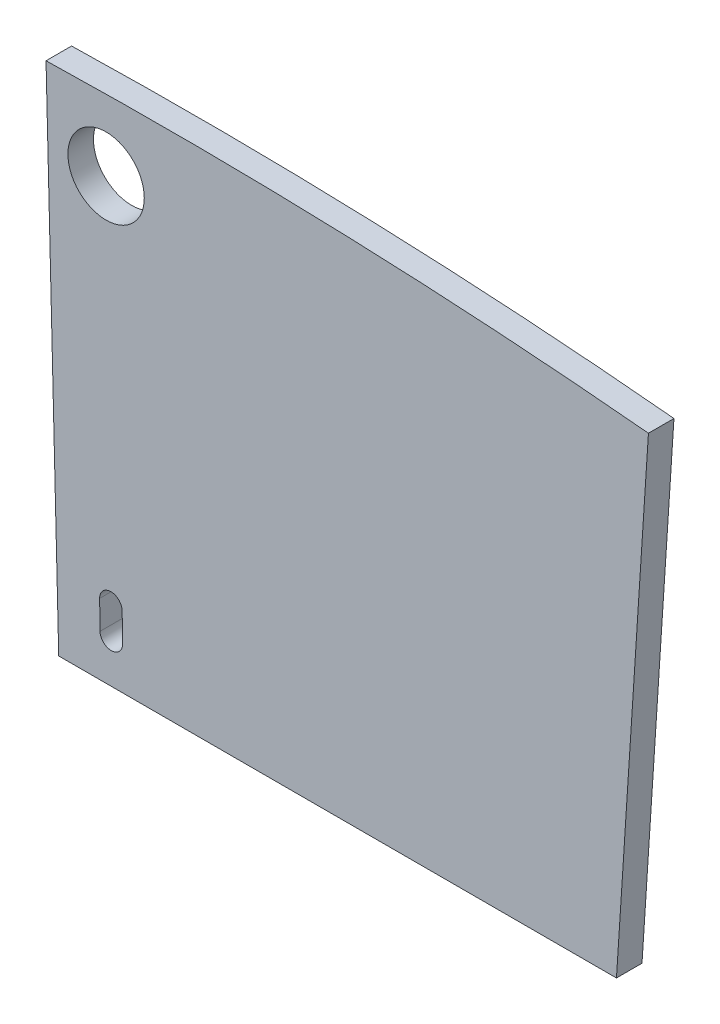
ISO-10303-21;
HEADER;
FILE_DESCRIPTION(('STEP AP214'),'2;1');
FILE_NAME('part.step','',(''),(''),'','','');
FILE_SCHEMA(('AUTOMOTIVE_DESIGN { 1 0 10303 214 1 1 1 1 }'));
ENDSEC;
DATA;
#1=APPLICATION_CONTEXT('core data for automotive mechanical design processes');
#2=APPLICATION_PROTOCOL_DEFINITION('international standard','automotive_design',2000,#1);
#3=PRODUCT_CONTEXT('',#1,'mechanical');
#4=PRODUCT('Part','Part','',(#3));
#5=PRODUCT_RELATED_PRODUCT_CATEGORY('part','',(#4));
#6=PRODUCT_DEFINITION_FORMATION('','',#4);
#7=PRODUCT_DEFINITION_CONTEXT('part definition',#1,'design');
#8=PRODUCT_DEFINITION('design','',#6,#7);
#9=PRODUCT_DEFINITION_SHAPE('','',#8);
#10=(LENGTH_UNIT() NAMED_UNIT(*) SI_UNIT(.MILLI.,.METRE.));
#11=(NAMED_UNIT(*) PLANE_ANGLE_UNIT() SI_UNIT($,.RADIAN.));
#12=(NAMED_UNIT(*) SI_UNIT($,.STERADIAN.) SOLID_ANGLE_UNIT());
#13=UNCERTAINTY_MEASURE_WITH_UNIT(LENGTH_MEASURE(1.E-05),#10,'distance_accuracy_value','');
#14=(GEOMETRIC_REPRESENTATION_CONTEXT(3) GLOBAL_UNCERTAINTY_ASSIGNED_CONTEXT((#13)) GLOBAL_UNIT_ASSIGNED_CONTEXT((#10,
#11,#12)) REPRESENTATION_CONTEXT('',''));
#15=CARTESIAN_POINT('',(0.,0.,0.));
#16=DIRECTION('',(0.,0.,1.));
#17=DIRECTION('',(1.,0.,0.));
#18=AXIS2_PLACEMENT_3D('',#15,#16,#17);
#19=CARTESIAN_POINT('',(-16.337044404827,167.45476352,0.899999999999998));
#20=DIRECTION('',(0.,0.,-1.));
#21=DIRECTION('',(-1.,0.,0.));
#22=AXIS2_PLACEMENT_3D('',#19,#20,#21);
#23=PLANE('',#22);
#24=CARTESIAN_POINT('',(-2.27104483273081,173.485135834076,0.899999999999998));
#25=DIRECTION('',(0.,0.,1.));
#26=DIRECTION('',(1.,0.,0.));
#27=AXIS2_PLACEMENT_3D('',#24,#25,#26);
#28=CIRCLE('',#27,1.34620000105857);
#29=CARTESIAN_POINT('',(-0.924844831672239,173.485135834076,0.899999999999998));
#30=VERTEX_POINT('',#29);
#31=EDGE_CURVE('E129',#30,#30,#28,.T.);
#32=ORIENTED_EDGE('',*,*,#31,.F.);
#33=EDGE_LOOP('',(#32));
#34=FACE_BOUND('',#33,.T.);
#35=CARTESIAN_POINT('',(0.,0.,0.900000000000001));
#36=DIRECTION('',(0.,0.,-1.));
#37=DIRECTION('',(1.,0.,0.));
#38=AXIS2_PLACEMENT_3D('',#35,#36,#37);
#39=CIRCLE('',#38,176.);
#40=CARTESIAN_POINT('',(-4.38748846474292,175.945303844609,0.899999999999998));
#41=VERTEX_POINT('',#40);
#42=CARTESIAN_POINT('',(16.8441765698866,175.192105175098,0.899999999999998));
#43=VERTEX_POINT('',#42);
#44=EDGE_CURVE('E113',#41,#43,#39,.T.);
#45=ORIENTED_EDGE('',*,*,#44,.F.);
#46=DIRECTION('',(0.0249289117314939,-0.999689226389823,0.));
#47=VECTOR('',#46,1.);
#48=CARTESIAN_POINT('',(-3.9399924992691,158.,0.899999999999998));
#49=LINE('',#48,#47);
#50=CARTESIAN_POINT('',(-3.9399924992691,158.,0.899999999999998));
#51=VERTEX_POINT('',#50);
#52=EDGE_CURVE('E49',#41,#51,#49,.T.);
#53=ORIENTED_EDGE('',*,*,#52,.T.);
#54=DIRECTION('',(-1.,0.,0.));
#55=VECTOR('',#54,1.);
#56=CARTESIAN_POINT('',(-15.7173464636271,158.,0.899999999999998));
#57=LINE('',#56,#55);
#58=CARTESIAN_POINT('',(15.717346463627,158.,0.899999999999998));
#59=VERTEX_POINT('',#58);
#60=EDGE_CURVE('E112',#59,#51,#57,.T.);
#61=ORIENTED_EDGE('',*,*,#60,.F.);
#62=DIRECTION('',(0.0654031292301392,0.997858923238604,0.));
#63=VECTOR('',#62,1.);
#64=CARTESIAN_POINT('',(16.0020624745624,162.343926895318,0.899999999999998));
#65=LINE('',#64,#63);
#66=EDGE_CURVE('E11',#59,#43,#65,.T.);
#67=ORIENTED_EDGE('',*,*,#66,.T.);
#68=EDGE_LOOP('',(#45,#53,#61,#67));
#69=FACE_BOUND('',#68,.T.);
#70=CARTESIAN_POINT('',(-2.10088065097746,160.486292411828,0.899999999999998));
#71=DIRECTION('',(0.,0.,1.));
#72=DIRECTION('',(1.,0.,0.));
#73=AXIS2_PLACEMENT_3D('',#70,#71,#72);
#74=CIRCLE('',#73,0.396875);
#75=CARTESIAN_POINT('',(-1.70403965222157,160.491487345073,0.899999999999998));
#76=VERTEX_POINT('',#75);
#77=CARTESIAN_POINT('',(-2.49772164973337,160.481097478583,0.899999999999998));
#78=VERTEX_POINT('',#77);
#79=EDGE_CURVE('E141',#76,#78,#74,.T.);
#80=ORIENTED_EDGE('',*,*,#79,.F.);
#81=DIRECTION('',(-0.0130895955776994,0.999914327573924,0.));
#82=VECTOR('',#81,1.);
#83=CARTESIAN_POINT('',(-1.70403965222157,160.491487345073,0.899999999999998));
#84=LINE('',#83,#82);
#85=CARTESIAN_POINT('',(-1.69094893513037,159.491487345073,0.899999999999998));
#86=VERTEX_POINT('',#85);
#87=EDGE_CURVE('E148',#86,#76,#84,.T.);
#88=ORIENTED_EDGE('',*,*,#87,.F.);
#89=CARTESIAN_POINT('',(-2.08778993388627,159.486292411828,0.899999999999998));
#90=DIRECTION('',(0.,0.,1.));
#91=DIRECTION('',(-1.,0.,0.));
#92=AXIS2_PLACEMENT_3D('',#89,#90,#91);
#93=CIRCLE('',#92,0.396875);
#94=CARTESIAN_POINT('',(-2.48463093264218,159.481097478583,0.899999999999998));
#95=VERTEX_POINT('',#94);
#96=EDGE_CURVE('E146',#95,#86,#93,.T.);
#97=ORIENTED_EDGE('',*,*,#96,.F.);
#98=DIRECTION('',(0.0130895955776989,-0.999914327573924,0.));
#99=VECTOR('',#98,1.);
#100=CARTESIAN_POINT('',(-2.49772164973337,160.481097478583,0.899999999999998));
#101=LINE('',#100,#99);
#102=EDGE_CURVE('E143',#78,#95,#101,.T.);
#103=ORIENTED_EDGE('',*,*,#102,.F.);
#104=EDGE_LOOP('',(#80,#88,#97,#103));
#105=FACE_BOUND('',#104,.T.);
#106=ADVANCED_FACE('F34',(#34,#69,#105),#23,.F.);
#107=CARTESIAN_POINT('',(-16.337044404827,167.45476352,0.));
#108=DIRECTION('',(0.,0.,-1.));
#109=DIRECTION('',(-1.,0.,0.));
#110=AXIS2_PLACEMENT_3D('',#107,#108,#109);
#111=PLANE('',#110);
#112=DIRECTION('',(0.0249289117314939,-0.999689226389823,0.));
#113=VECTOR('',#112,1.);
#114=CARTESIAN_POINT('',(-3.9399924992691,158.,0.));
#115=LINE('',#114,#113);
#116=CARTESIAN_POINT('',(-4.38748846474292,175.945303844609,0.));
#117=VERTEX_POINT('',#116);
#118=CARTESIAN_POINT('',(-3.9399924992691,158.,0.));
#119=VERTEX_POINT('',#118);
#120=EDGE_CURVE('E100',#117,#119,#115,.T.);
#121=ORIENTED_EDGE('',*,*,#120,.F.);
#122=CARTESIAN_POINT('',(0.,0.,0.));
#123=DIRECTION('',(0.,0.,-1.));
#124=DIRECTION('',(1.,0.,0.));
#125=AXIS2_PLACEMENT_3D('',#122,#123,#124);
#126=CIRCLE('',#125,176.);
#127=CARTESIAN_POINT('',(16.8441765698866,175.192105175098,0.));
#128=VERTEX_POINT('',#127);
#129=EDGE_CURVE('E127',#117,#128,#126,.T.);
#130=ORIENTED_EDGE('',*,*,#129,.T.);
#131=DIRECTION('',(0.0654031292301392,0.997858923238604,0.));
#132=VECTOR('',#131,1.);
#133=CARTESIAN_POINT('',(16.0020624745624,162.343926895318,0.));
#134=LINE('',#133,#132);
#135=CARTESIAN_POINT('',(15.717346463627,158.,0.));
#136=VERTEX_POINT('',#135);
#137=EDGE_CURVE('E38',#136,#128,#134,.T.);
#138=ORIENTED_EDGE('',*,*,#137,.F.);
#139=DIRECTION('',(-1.,0.,0.));
#140=VECTOR('',#139,1.);
#141=CARTESIAN_POINT('',(-15.7173464636271,158.,0.));
#142=LINE('',#141,#140);
#143=EDGE_CURVE('E123',#136,#119,#142,.T.);
#144=ORIENTED_EDGE('',*,*,#143,.T.);
#145=EDGE_LOOP('',(#121,#130,#138,#144));
#146=FACE_BOUND('',#145,.T.);
#147=CARTESIAN_POINT('',(-2.27104483273081,173.485135834076,0.));
#148=DIRECTION('',(0.,0.,1.));
#149=DIRECTION('',(1.,0.,0.));
#150=AXIS2_PLACEMENT_3D('',#147,#148,#149);
#151=CIRCLE('',#150,1.34620000105857);
#152=CARTESIAN_POINT('',(-0.924844831672239,173.485135834076,0.));
#153=VERTEX_POINT('',#152);
#154=EDGE_CURVE('E169',#153,#153,#151,.T.);
#155=ORIENTED_EDGE('',*,*,#154,.T.);
#156=EDGE_LOOP('',(#155));
#157=FACE_BOUND('',#156,.T.);
#158=DIRECTION('',(-0.0130895955776994,0.999914327573924,0.));
#159=VECTOR('',#158,1.);
#160=CARTESIAN_POINT('',(-1.70403965222157,160.491487345073,0.));
#161=LINE('',#160,#159);
#162=CARTESIAN_POINT('',(-1.69094893513037,159.491487345073,0.));
#163=VERTEX_POINT('',#162);
#164=CARTESIAN_POINT('',(-1.70403965222157,160.491487345073,0.));
#165=VERTEX_POINT('',#164);
#166=EDGE_CURVE('E144',#163,#165,#161,.T.);
#167=ORIENTED_EDGE('',*,*,#166,.T.);
#168=CARTESIAN_POINT('',(-2.10088065097746,160.486292411828,0.));
#169=DIRECTION('',(0.,0.,1.));
#170=DIRECTION('',(1.,0.,0.));
#171=AXIS2_PLACEMENT_3D('',#168,#169,#170);
#172=CIRCLE('',#171,0.396875);
#173=CARTESIAN_POINT('',(-2.49772164973337,160.481097478583,0.));
#174=VERTEX_POINT('',#173);
#175=EDGE_CURVE('E105',#165,#174,#172,.T.);
#176=ORIENTED_EDGE('',*,*,#175,.T.);
#177=DIRECTION('',(0.0130895955776989,-0.999914327573924,0.));
#178=VECTOR('',#177,1.);
#179=CARTESIAN_POINT('',(-2.49772164973337,160.481097478583,0.));
#180=LINE('',#179,#178);
#181=CARTESIAN_POINT('',(-2.48463093264218,159.481097478583,0.));
#182=VERTEX_POINT('',#181);
#183=EDGE_CURVE('E153',#174,#182,#180,.T.);
#184=ORIENTED_EDGE('',*,*,#183,.T.);
#185=CARTESIAN_POINT('',(-2.08778993388627,159.486292411828,0.));
#186=DIRECTION('',(0.,0.,1.));
#187=DIRECTION('',(-1.,0.,0.));
#188=AXIS2_PLACEMENT_3D('',#185,#186,#187);
#189=CIRCLE('',#188,0.396875);
#190=EDGE_CURVE('E156',#182,#163,#189,.T.);
#191=ORIENTED_EDGE('',*,*,#190,.T.);
#192=EDGE_LOOP('',(#167,#176,#184,#191));
#193=FACE_BOUND('',#192,.T.);
#194=ADVANCED_FACE('F174',(#146,#157,#193),#111,.T.);
#195=CARTESIAN_POINT('',(-15.7173464636271,158.,0.899999999999998));
#196=DIRECTION('',(0.,-1.,0.));
#197=DIRECTION('',(0.,0.,-1.));
#198=AXIS2_PLACEMENT_3D('',#195,#196,#197);
#199=PLANE('',#198);
#200=DIRECTION('',(0.,0.,-1.));
#201=VECTOR('',#200,1.);
#202=CARTESIAN_POINT('',(-3.9399924992691,158.,0.899999999999998));
#203=LINE('',#202,#201);
#204=EDGE_CURVE('E97',#51,#119,#203,.T.);
#205=ORIENTED_EDGE('',*,*,#204,.T.);
#206=ORIENTED_EDGE('',*,*,#143,.F.);
#207=DIRECTION('',(0.,0.,-1.));
#208=VECTOR('',#207,1.);
#209=CARTESIAN_POINT('',(15.717346463627,158.,0.899999999999998));
#210=LINE('',#209,#208);
#211=EDGE_CURVE('E118',#59,#136,#210,.T.);
#212=ORIENTED_EDGE('',*,*,#211,.F.);
#213=ORIENTED_EDGE('',*,*,#60,.T.);
#214=EDGE_LOOP('',(#205,#206,#212,#213));
#215=FACE_BOUND('',#214,.T.);
#216=ADVANCED_FACE('F116',(#215),#199,.T.);
#217=CARTESIAN_POINT('',(16.0020624745624,162.343926895318,0.899999999999998));
#218=DIRECTION('',(-0.997858923238604,0.0654031292301395,0.));
#219=DIRECTION('',(-0.0654031292301392,-0.997858923238604,0.));
#220=AXIS2_PLACEMENT_3D('',#217,#218,#219);
#221=PLANE('',#220);
#222=ORIENTED_EDGE('',*,*,#137,.T.);
#223=DIRECTION('',(0.,0.,-1.));
#224=VECTOR('',#223,1.);
#225=CARTESIAN_POINT('',(16.8441765698866,175.192105175098,0.899999999999998));
#226=LINE('',#225,#224);
#227=EDGE_CURVE('E119',#43,#128,#226,.T.);
#228=ORIENTED_EDGE('',*,*,#227,.F.);
#229=ORIENTED_EDGE('',*,*,#66,.F.);
#230=ORIENTED_EDGE('',*,*,#211,.T.);
#231=EDGE_LOOP('',(#222,#228,#229,#230));
#232=FACE_BOUND('',#231,.T.);
#233=ADVANCED_FACE('F36',(#232),#221,.F.);
#234=CARTESIAN_POINT('',(0.,0.,0.900000000000001));
#235=DIRECTION('',(0.,0.,-1.));
#236=DIRECTION('',(-1.,0.,0.));
#237=AXIS2_PLACEMENT_3D('',#234,#235,#236);
#238=CYLINDRICAL_SURFACE('',#237,176.);
#239=DIRECTION('',(0.,0.,-1.));
#240=VECTOR('',#239,1.);
#241=CARTESIAN_POINT('',(-4.38748846474292,175.945303844609,0.899999999999998));
#242=LINE('',#241,#240);
#243=EDGE_CURVE('E106',#41,#117,#242,.T.);
#244=ORIENTED_EDGE('',*,*,#243,.F.);
#245=ORIENTED_EDGE('',*,*,#44,.T.);
#246=ORIENTED_EDGE('',*,*,#227,.T.);
#247=ORIENTED_EDGE('',*,*,#129,.F.);
#248=EDGE_LOOP('',(#244,#245,#246,#247));
#249=FACE_BOUND('',#248,.T.);
#250=ADVANCED_FACE('F137',(#249),#238,.T.);
#251=CARTESIAN_POINT('',(-2.27104483273081,173.485135834076,0.899999999999998));
#252=DIRECTION('',(0.,0.,-1.));
#253=DIRECTION('',(-1.,0.,0.));
#254=AXIS2_PLACEMENT_3D('',#251,#252,#253);
#255=CYLINDRICAL_SURFACE('',#254,1.34620000105857);
#256=ORIENTED_EDGE('',*,*,#31,.T.);
#257=EDGE_LOOP('',(#256));
#258=FACE_BOUND('',#257,.T.);
#259=ORIENTED_EDGE('',*,*,#154,.F.);
#260=EDGE_LOOP('',(#259));
#261=FACE_BOUND('',#260,.T.);
#262=ADVANCED_FACE('F177',(#258,#261),#255,.F.);
#263=CARTESIAN_POINT('',(-2.10088065097746,160.486292411828,0.899999999999998));
#264=DIRECTION('',(0.,0.,-1.));
#265=DIRECTION('',(-1.,0.,0.));
#266=AXIS2_PLACEMENT_3D('',#263,#264,#265);
#267=CYLINDRICAL_SURFACE('',#266,0.396875);
#268=ORIENTED_EDGE('',*,*,#175,.F.);
#269=DIRECTION('',(0.,0.,-1.));
#270=VECTOR('',#269,1.);
#271=CARTESIAN_POINT('',(-1.70403965222157,160.491487345073,0.899999999999998));
#272=LINE('',#271,#270);
#273=EDGE_CURVE('E150',#76,#165,#272,.T.);
#274=ORIENTED_EDGE('',*,*,#273,.F.);
#275=ORIENTED_EDGE('',*,*,#79,.T.);
#276=DIRECTION('',(0.,0.,-1.));
#277=VECTOR('',#276,1.);
#278=CARTESIAN_POINT('',(-2.49772164973337,160.481097478583,0.899999999999998));
#279=LINE('',#278,#277);
#280=EDGE_CURVE('E166',#78,#174,#279,.T.);
#281=ORIENTED_EDGE('',*,*,#280,.T.);
#282=EDGE_LOOP('',(#268,#274,#275,#281));
#283=FACE_BOUND('',#282,.T.);
#284=ADVANCED_FACE('F179',(#283),#267,.F.);
#285=CARTESIAN_POINT('',(-2.49772164973337,160.481097478583,0.899999999999998));
#286=DIRECTION('',(0.999914327573924,0.0130895955776986,0.));
#287=DIRECTION('',(-0.0130895955776989,0.999914327573924,0.));
#288=AXIS2_PLACEMENT_3D('',#285,#286,#287);
#289=PLANE('',#288);
#290=ORIENTED_EDGE('',*,*,#183,.F.);
#291=ORIENTED_EDGE('',*,*,#280,.F.);
#292=ORIENTED_EDGE('',*,*,#102,.T.);
#293=DIRECTION('',(0.,0.,-1.));
#294=VECTOR('',#293,1.);
#295=CARTESIAN_POINT('',(-2.48463093264218,159.481097478583,0.899999999999998));
#296=LINE('',#295,#294);
#297=EDGE_CURVE('E164',#95,#182,#296,.T.);
#298=ORIENTED_EDGE('',*,*,#297,.T.);
#299=EDGE_LOOP('',(#290,#291,#292,#298));
#300=FACE_BOUND('',#299,.T.);
#301=ADVANCED_FACE('F186',(#300),#289,.T.);
#302=CARTESIAN_POINT('',(-2.08778993388627,159.486292411828,0.899999999999998));
#303=DIRECTION('',(0.,0.,-1.));
#304=DIRECTION('',(-1.,0.,0.));
#305=AXIS2_PLACEMENT_3D('',#302,#303,#304);
#306=CYLINDRICAL_SURFACE('',#305,0.396875);
#307=ORIENTED_EDGE('',*,*,#190,.F.);
#308=ORIENTED_EDGE('',*,*,#297,.F.);
#309=ORIENTED_EDGE('',*,*,#96,.T.);
#310=DIRECTION('',(0.,0.,-1.));
#311=VECTOR('',#310,1.);
#312=CARTESIAN_POINT('',(-1.69094893513037,159.491487345073,0.899999999999998));
#313=LINE('',#312,#311);
#314=EDGE_CURVE('E57',#86,#163,#313,.T.);
#315=ORIENTED_EDGE('',*,*,#314,.T.);
#316=EDGE_LOOP('',(#307,#308,#309,#315));
#317=FACE_BOUND('',#316,.T.);
#318=ADVANCED_FACE('F229',(#317),#306,.F.);
#319=CARTESIAN_POINT('',(-1.70403965222157,160.491487345073,0.899999999999998));
#320=DIRECTION('',(-0.999914327573925,-0.013089595577699,0.));
#321=DIRECTION('',(0.0130895955776994,-0.999914327573924,0.));
#322=AXIS2_PLACEMENT_3D('',#319,#320,#321);
#323=PLANE('',#322);
#324=ORIENTED_EDGE('',*,*,#166,.F.);
#325=ORIENTED_EDGE('',*,*,#314,.F.);
#326=ORIENTED_EDGE('',*,*,#87,.T.);
#327=ORIENTED_EDGE('',*,*,#273,.T.);
#328=EDGE_LOOP('',(#324,#325,#326,#327));
#329=FACE_BOUND('',#328,.T.);
#330=ADVANCED_FACE('F239',(#329),#323,.T.);
#331=CARTESIAN_POINT('',(-3.9399924992691,158.,0.899999999999998));
#332=DIRECTION('',(0.999689226389824,0.0249289117314935,0.));
#333=DIRECTION('',(-0.0249289117314939,0.999689226389823,0.));
#334=AXIS2_PLACEMENT_3D('',#331,#332,#333);
#335=PLANE('',#334);
#336=ORIENTED_EDGE('',*,*,#120,.T.);
#337=ORIENTED_EDGE('',*,*,#204,.F.);
#338=ORIENTED_EDGE('',*,*,#52,.F.);
#339=ORIENTED_EDGE('',*,*,#243,.T.);
#340=EDGE_LOOP('',(#336,#337,#338,#339));
#341=FACE_BOUND('',#340,.T.);
#342=ADVANCED_FACE('F98',(#341),#335,.F.);
#343=CLOSED_SHELL('',(#106,#194,#216,#233,#250,#262,#284,#301,#318,#330,#342));
#344=MANIFOLD_SOLID_BREP('B2',#343);
#345=ADVANCED_BREP_SHAPE_REPRESENTATION('',(#18,#344),#14);
#346=SHAPE_DEFINITION_REPRESENTATION(#9,#345);
ENDSEC;
END-ISO-10303-21;
